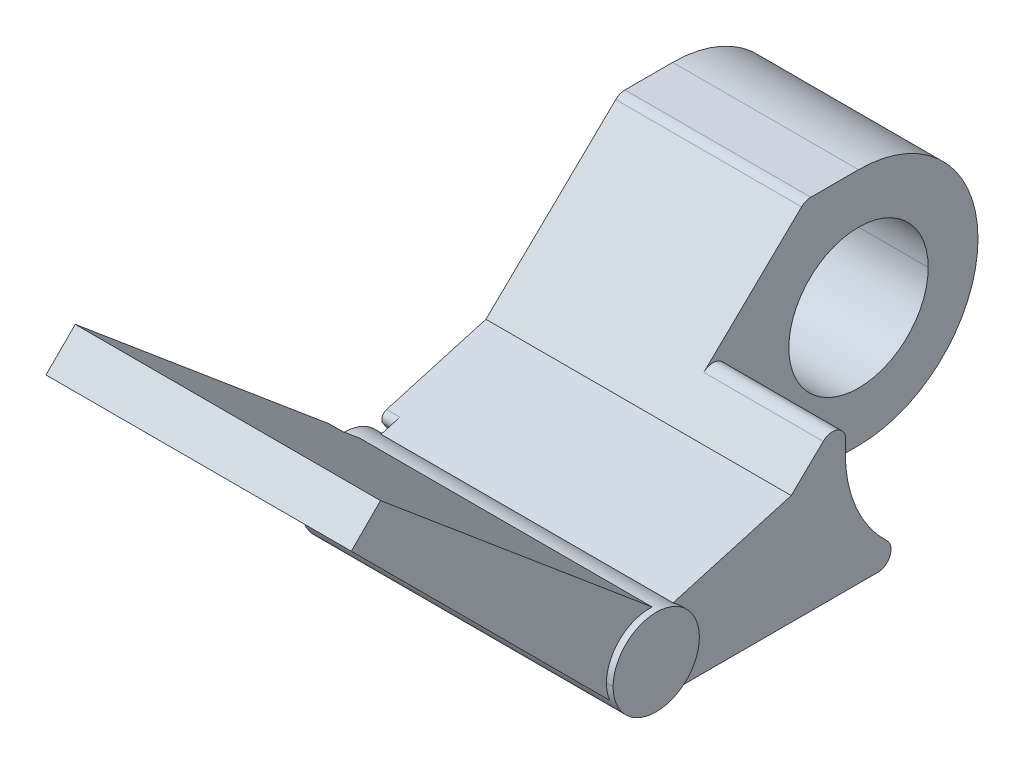
ISO-10303-21;
HEADER;
FILE_DESCRIPTION(('STEP AP214'),'2;1');
FILE_NAME('part.step','',(''),(''),'','','');
FILE_SCHEMA(('AUTOMOTIVE_DESIGN { 1 0 10303 214 1 1 1 1 }'));
ENDSEC;
DATA;
#1=APPLICATION_CONTEXT('core data for automotive mechanical design processes');
#2=APPLICATION_PROTOCOL_DEFINITION('international standard','automotive_design',2000,#1);
#3=PRODUCT_CONTEXT('',#1,'mechanical');
#4=PRODUCT('Part','Part','',(#3));
#5=PRODUCT_RELATED_PRODUCT_CATEGORY('part','',(#4));
#6=PRODUCT_DEFINITION_FORMATION('','',#4);
#7=PRODUCT_DEFINITION_CONTEXT('part definition',#1,'design');
#8=PRODUCT_DEFINITION('design','',#6,#7);
#9=PRODUCT_DEFINITION_SHAPE('','',#8);
#10=(LENGTH_UNIT() NAMED_UNIT(*) SI_UNIT(.MILLI.,.METRE.));
#11=(NAMED_UNIT(*) PLANE_ANGLE_UNIT() SI_UNIT($,.RADIAN.));
#12=(NAMED_UNIT(*) SI_UNIT($,.STERADIAN.) SOLID_ANGLE_UNIT());
#13=UNCERTAINTY_MEASURE_WITH_UNIT(LENGTH_MEASURE(1.E-05),#10,'distance_accuracy_value','');
#14=(GEOMETRIC_REPRESENTATION_CONTEXT(3) GLOBAL_UNCERTAINTY_ASSIGNED_CONTEXT((#13)) GLOBAL_UNIT_ASSIGNED_CONTEXT((#10,
#11,#12)) REPRESENTATION_CONTEXT('',''));
#15=CARTESIAN_POINT('',(0.,0.,0.));
#16=DIRECTION('',(0.,0.,1.));
#17=DIRECTION('',(1.,0.,0.));
#18=AXIS2_PLACEMENT_3D('',#15,#16,#17);
#19=CARTESIAN_POINT('',(-23.,17.,3.59597377416485));
#20=DIRECTION('',(1.,0.,0.));
#21=DIRECTION('',(0.,0.,1.));
#22=AXIS2_PLACEMENT_3D('',#19,#20,#21);
#23=CYLINDRICAL_SURFACE('',#22,1.);
#24=CARTESIAN_POINT('',(-23.,17.,3.59597377416485));
#25=DIRECTION('',(1.,0.,0.));
#26=DIRECTION('',(0.,0.,-1.));
#27=AXIS2_PLACEMENT_3D('',#24,#25,#26);
#28=CIRCLE('',#27,1.);
#29=CARTESIAN_POINT('',(-23.,18.,3.59597377416485));
#30=VERTEX_POINT('',#29);
#31=CARTESIAN_POINT('',(-23.,17.7193398003386,4.29063214462384));
#32=VERTEX_POINT('',#31);
#33=EDGE_CURVE('E291',#30,#32,#28,.T.);
#34=ORIENTED_EDGE('',*,*,#33,.T.);
#35=DIRECTION('',(1.,0.,0.));
#36=VECTOR('',#35,1.);
#37=CARTESIAN_POINT('',(-23.,17.7193398003386,4.29063214462384));
#38=LINE('',#37,#36);
#39=CARTESIAN_POINT('',(-9.,17.7193398003386,4.29063214462385));
#40=VERTEX_POINT('',#39);
#41=EDGE_CURVE('E510',#32,#40,#38,.T.);
#42=ORIENTED_EDGE('',*,*,#41,.T.);
#43=CARTESIAN_POINT('',(-9.,17.,3.59597377416485));
#44=DIRECTION('',(-1.,0.,0.));
#45=DIRECTION('',(0.,0.,1.));
#46=AXIS2_PLACEMENT_3D('',#43,#44,#45);
#47=CIRCLE('',#46,1.);
#48=CARTESIAN_POINT('',(-9.,18.,3.59597377416485));
#49=VERTEX_POINT('',#48);
#50=EDGE_CURVE('E302',#40,#49,#47,.T.);
#51=ORIENTED_EDGE('',*,*,#50,.T.);
#52=DIRECTION('',(-1.,0.,0.));
#53=VECTOR('',#52,1.);
#54=CARTESIAN_POINT('',(-23.,18.,3.59597377416485));
#55=LINE('',#54,#53);
#56=EDGE_CURVE('E409',#49,#30,#55,.T.);
#57=ORIENTED_EDGE('',*,*,#56,.T.);
#58=EDGE_LOOP('',(#34,#42,#51,#57));
#59=FACE_BOUND('',#58,.T.);
#60=ADVANCED_FACE('F14',(#59),#23,.T.);
#61=CARTESIAN_POINT('',(-22.,0.5,21.302643481786));
#62=DIRECTION('',(-1.,0.,0.));
#63=DIRECTION('',(0.,0.,-1.));
#64=AXIS2_PLACEMENT_3D('',#61,#62,#63);
#65=CYLINDRICAL_SURFACE('',#64,0.5);
#66=CARTESIAN_POINT('',(-22.,0.5,21.302643481786));
#67=DIRECTION('',(-1.,0.,0.));
#68=DIRECTION('',(0.,0.,-1.));
#69=AXIS2_PLACEMENT_3D('',#66,#67,#68);
#70=CIRCLE('',#69,0.5);
#71=CARTESIAN_POINT('',(-22.,0.,21.302643481786));
#72=VERTEX_POINT('',#71);
#73=CARTESIAN_POINT('',(-22.,0.793724262730775,21.7072742486381));
#74=VERTEX_POINT('',#73);
#75=EDGE_CURVE('E308',#72,#74,#70,.T.);
#76=ORIENTED_EDGE('',*,*,#75,.T.);
#77=DIRECTION('',(-1.,0.,0.));
#78=VECTOR('',#77,1.);
#79=CARTESIAN_POINT('',(-22.,0.793724262730776,21.7072742486381));
#80=LINE('',#79,#78);
#81=CARTESIAN_POINT('',(-23.,0.793724262730775,21.7072742486381));
#82=VERTEX_POINT('',#81);
#83=EDGE_CURVE('E403',#74,#82,#80,.T.);
#84=ORIENTED_EDGE('',*,*,#83,.T.);
#85=CARTESIAN_POINT('',(-23.,0.5,21.302643481786));
#86=DIRECTION('',(1.,0.,0.));
#87=DIRECTION('',(0.,0.,-1.));
#88=AXIS2_PLACEMENT_3D('',#85,#86,#87);
#89=CIRCLE('',#88,0.5);
#90=CARTESIAN_POINT('',(-23.,0.,21.302643481786));
#91=VERTEX_POINT('',#90);
#92=EDGE_CURVE('E339',#82,#91,#89,.T.);
#93=ORIENTED_EDGE('',*,*,#92,.T.);
#94=DIRECTION('',(1.,0.,0.));
#95=VECTOR('',#94,1.);
#96=CARTESIAN_POINT('',(-22.,0.,21.302643481786));
#97=LINE('',#96,#95);
#98=EDGE_CURVE('E290',#91,#72,#97,.T.);
#99=ORIENTED_EDGE('',*,*,#98,.T.);
#100=EDGE_LOOP('',(#76,#84,#93,#99));
#101=FACE_BOUND('',#100,.T.);
#102=ADVANCED_FACE('F655',(#101),#65,.T.);
#103=CARTESIAN_POINT('',(-22.,5.64730748684892,21.4198749707261));
#104=DIRECTION('',(-1.,0.,0.));
#105=DIRECTION('',(0.,0.,-1.));
#106=AXIS2_PLACEMENT_3D('',#103,#104,#105);
#107=CYLINDRICAL_SURFACE('',#106,0.5);
#108=CARTESIAN_POINT('',(-22.,5.64730748684892,21.4198749707261));
#109=DIRECTION('',(-1.,0.,0.));
#110=DIRECTION('',(0.,0.,-1.));
#111=AXIS2_PLACEMENT_3D('',#108,#109,#110);
#112=CIRCLE('',#111,0.5);
#113=CARTESIAN_POINT('',(-22.,5.33546616289159,21.8107137977028));
#114=VERTEX_POINT('',#113);
#115=CARTESIAN_POINT('',(-22.,6.12793833481808,21.5576936486347));
#116=VERTEX_POINT('',#115);
#117=EDGE_CURVE('E466',#114,#116,#112,.T.);
#118=ORIENTED_EDGE('',*,*,#117,.T.);
#119=DIRECTION('',(-1.,0.,0.));
#120=VECTOR('',#119,1.);
#121=CARTESIAN_POINT('',(-23.,6.12793833481808,21.5576936486347));
#122=LINE('',#121,#120);
#123=CARTESIAN_POINT('',(-23.,6.12793833481808,21.5576936486347));
#124=VERTEX_POINT('',#123);
#125=EDGE_CURVE('E387',#116,#124,#122,.T.);
#126=ORIENTED_EDGE('',*,*,#125,.T.);
#127=CARTESIAN_POINT('',(-23.,5.64730748684892,21.4198749707261));
#128=DIRECTION('',(1.,0.,0.));
#129=DIRECTION('',(0.,0.,-1.));
#130=AXIS2_PLACEMENT_3D('',#127,#128,#129);
#131=CIRCLE('',#130,0.5);
#132=CARTESIAN_POINT('',(-23.,5.33546616289159,21.8107137977028));
#133=VERTEX_POINT('',#132);
#134=EDGE_CURVE('E295',#124,#133,#131,.T.);
#135=ORIENTED_EDGE('',*,*,#134,.T.);
#136=DIRECTION('',(1.,0.,0.));
#137=VECTOR('',#136,1.);
#138=CARTESIAN_POINT('',(-22.,5.33546616289159,21.8107137977028));
#139=LINE('',#138,#137);
#140=EDGE_CURVE('E301',#133,#114,#139,.T.);
#141=ORIENTED_EDGE('',*,*,#140,.T.);
#142=EDGE_LOOP('',(#118,#126,#135,#141));
#143=FACE_BOUND('',#142,.T.);
#144=ADVANCED_FACE('F543',(#143),#107,.T.);
#145=CARTESIAN_POINT('',(-22.,3.64878220999846,28.9416754288119));
#146=DIRECTION('',(-1.,0.,0.));
#147=DIRECTION('',(0.,0.,-1.));
#148=AXIS2_PLACEMENT_3D('',#145,#146,#147);
#149=CYLINDRICAL_SURFACE('',#148,0.5);
#150=CARTESIAN_POINT('',(-23.,3.64878220999846,28.9416754288119));
#151=DIRECTION('',(1.,0.,0.));
#152=DIRECTION('',(0.,0.,-1.));
#153=AXIS2_PLACEMENT_3D('',#150,#151,#152);
#154=CIRCLE('',#153,0.5);
#155=CARTESIAN_POINT('',(-23.,3.29522881940518,29.2952288194051));
#156=VERTEX_POINT('',#155);
#157=CARTESIAN_POINT('',(-23.,3.57206150684706,28.4475965548373));
#158=VERTEX_POINT('',#157);
#159=EDGE_CURVE('E451',#156,#158,#154,.T.);
#160=ORIENTED_EDGE('',*,*,#159,.T.);
#161=DIRECTION('',(1.,0.,0.));
#162=VECTOR('',#161,1.);
#163=CARTESIAN_POINT('',(-22.,3.57206150684706,28.4475965548373));
#164=LINE('',#163,#162);
#165=CARTESIAN_POINT('',(-22.,3.57206150684706,28.4475965548373));
#166=VERTEX_POINT('',#165);
#167=EDGE_CURVE('E307',#158,#166,#164,.T.);
#168=ORIENTED_EDGE('',*,*,#167,.T.);
#169=CARTESIAN_POINT('',(-22.,3.64878220999846,28.9416754288119));
#170=DIRECTION('',(-1.,0.,0.));
#171=DIRECTION('',(0.,0.,-1.));
#172=AXIS2_PLACEMENT_3D('',#169,#170,#171);
#173=CIRCLE('',#172,0.5);
#174=CARTESIAN_POINT('',(-22.,3.29522881940518,29.2952288194051));
#175=VERTEX_POINT('',#174);
#176=EDGE_CURVE('E25',#166,#175,#173,.T.);
#177=ORIENTED_EDGE('',*,*,#176,.T.);
#178=DIRECTION('',(-1.,0.,0.));
#179=VECTOR('',#178,1.);
#180=CARTESIAN_POINT('',(-23.,3.29522881940518,29.2952288194051));
#181=LINE('',#180,#179);
#182=EDGE_CURVE('E317',#175,#156,#181,.T.);
#183=ORIENTED_EDGE('',*,*,#182,.T.);
#184=EDGE_LOOP('',(#160,#168,#177,#183));
#185=FACE_BOUND('',#184,.T.);
#186=ADVANCED_FACE('F1264',(#185),#149,.T.);
#187=CARTESIAN_POINT('',(-22.,6.98529548453996,26.2094030110542));
#188=DIRECTION('',(-1.,0.,0.));
#189=DIRECTION('',(0.,0.,-1.));
#190=AXIS2_PLACEMENT_3D('',#187,#188,#189);
#191=CYLINDRICAL_SURFACE('',#190,0.5);
#192=DIRECTION('',(-1.,0.,0.));
#193=VECTOR('',#192,1.);
#194=CARTESIAN_POINT('',(-22.,6.98529548453996,25.7094030110542));
#195=LINE('',#194,#193);
#196=CARTESIAN_POINT('',(-22.,6.98529548453996,25.7094030110542));
#197=VERTEX_POINT('',#196);
#198=CARTESIAN_POINT('',(-23.,6.98529548453996,25.7094030110542));
#199=VERTEX_POINT('',#198);
#200=EDGE_CURVE('E398',#197,#199,#195,.T.);
#201=ORIENTED_EDGE('',*,*,#200,.F.);
#202=CARTESIAN_POINT('',(-22.,6.98529548453996,26.2094030110542));
#203=DIRECTION('',(-1.,0.,0.));
#204=DIRECTION('',(0.,0.,-1.));
#205=AXIS2_PLACEMENT_3D('',#202,#203,#204);
#206=CIRCLE('',#205,0.5);
#207=CARTESIAN_POINT('',(-22.,6.5160438079131,26.0367679509335));
#208=VERTEX_POINT('',#207);
#209=EDGE_CURVE('E9',#197,#208,#206,.T.);
#210=ORIENTED_EDGE('',*,*,#209,.T.);
#211=DIRECTION('',(-1.,0.,0.));
#212=VECTOR('',#211,1.);
#213=CARTESIAN_POINT('',(-22.,6.5160438079131,26.0367679509335));
#214=LINE('',#213,#212);
#215=CARTESIAN_POINT('',(-23.,6.5160438079131,26.0367679509335));
#216=VERTEX_POINT('',#215);
#217=EDGE_CURVE('E469',#208,#216,#214,.T.);
#218=ORIENTED_EDGE('',*,*,#217,.T.);
#219=CARTESIAN_POINT('',(-23.,6.98529548453996,26.2094030110542));
#220=DIRECTION('',(1.,0.,0.));
#221=DIRECTION('',(0.,0.,-1.));
#222=AXIS2_PLACEMENT_3D('',#219,#220,#221);
#223=CIRCLE('',#222,0.5);
#224=EDGE_CURVE('E371',#216,#199,#223,.T.);
#225=ORIENTED_EDGE('',*,*,#224,.T.);
#226=EDGE_LOOP('',(#201,#210,#218,#225));
#227=FACE_BOUND('',#226,.T.);
#228=ADVANCED_FACE('F1259',(#227),#191,.T.);
#229=CARTESIAN_POINT('',(-22.,2.99665623321162,24.7420050000283));
#230=DIRECTION('',(-1.,0.,0.));
#231=DIRECTION('',(0.,0.,1.));
#232=AXIS2_PLACEMENT_3D('',#229,#230,#231);
#233=PLANE('',#232);
#234=DIRECTION('',(0.,-0.642787609686543,-0.766044443118975));
#235=VECTOR('',#234,1.);
#236=CARTESIAN_POINT('',(-22.,-8.42344976404674,7.06811359025203));
#237=LINE('',#236,#235);
#238=CARTESIAN_POINT('',(-22.,7.36831770609945,25.8880092062109));
#239=VERTEX_POINT('',#238);
#240=CARTESIAN_POINT('',(-22.,6.24062355295245,24.5440756478505));
#241=VERTEX_POINT('',#240);
#242=EDGE_CURVE('E437',#239,#241,#237,.T.);
#243=ORIENTED_EDGE('',*,*,#242,.T.);
#244=CARTESIAN_POINT('',(-22.,2.99665623321162,24.7420050000283));
#245=DIRECTION('',(1.,0.,0.));
#246=DIRECTION('',(0.,0.,-1.));
#247=AXIS2_PLACEMENT_3D('',#244,#245,#246);
#248=CIRCLE('',#247,3.25);
#249=CARTESIAN_POINT('',(-22.,2.99665623321162,27.9920050000283));
#250=VERTEX_POINT('',#249);
#251=EDGE_CURVE('E258',#241,#250,#248,.T.);
#252=ORIENTED_EDGE('',*,*,#251,.T.);
#253=CARTESIAN_POINT('',(-22.,2.99665623321162,24.7420050000283));
#254=DIRECTION('',(1.,0.,0.));
#255=DIRECTION('',(0.,0.,-1.));
#256=AXIS2_PLACEMENT_3D('',#253,#254,#255);
#257=CIRCLE('',#256,3.25);
#258=CARTESIAN_POINT('',(-22.,1.73866123323988,27.7386612332399));
#259=VERTEX_POINT('',#258);
#260=EDGE_CURVE('E324',#250,#259,#257,.T.);
#261=ORIENTED_EDGE('',*,*,#260,.T.);
#262=DIRECTION('',(0.,0.707106781186549,0.707106781186546));
#263=VECTOR('',#262,1.);
#264=CARTESIAN_POINT('',(-22.,-13.,13.));
#265=LINE('',#264,#263);
#266=EDGE_CURVE('E314',#259,#175,#265,.T.);
#267=ORIENTED_EDGE('',*,*,#266,.T.);
#268=ORIENTED_EDGE('',*,*,#176,.F.);
#269=CARTESIAN_POINT('',(-22.,2.99665623321162,24.7420050000283));
#270=DIRECTION('',(1.,0.,0.));
#271=DIRECTION('',(0.,0.,-1.));
#272=AXIS2_PLACEMENT_3D('',#269,#270,#271);
#273=CIRCLE('',#272,3.75);
#274=EDGE_CURVE('E303',#208,#166,#273,.T.);
#275=ORIENTED_EDGE('',*,*,#274,.F.);
#276=ORIENTED_EDGE('',*,*,#209,.F.);
#277=CARTESIAN_POINT('',(-22.,6.98529548453996,26.2094030110542));
#278=DIRECTION('',(-1.,0.,0.));
#279=DIRECTION('',(0.,0.,-1.));
#280=AXIS2_PLACEMENT_3D('',#277,#278,#279);
#281=CIRCLE('',#280,0.5);
#282=EDGE_CURVE('E486',#239,#197,#281,.T.);
#283=ORIENTED_EDGE('',*,*,#282,.F.);
#284=EDGE_LOOP('',(#243,#252,#261,#267,#268,#275,#276,#283));
#285=FACE_BOUND('',#284,.T.);
#286=ADVANCED_FACE('F1263',(#285),#233,.T.);
#287=CARTESIAN_POINT('',(-22.,2.99665623321162,24.7420050000283));
#288=DIRECTION('',(-1.,0.,0.));
#289=DIRECTION('',(0.,0.,-1.));
#290=AXIS2_PLACEMENT_3D('',#287,#288,#289);
#291=CYLINDRICAL_SURFACE('',#290,3.75);
#292=ORIENTED_EDGE('',*,*,#274,.T.);
#293=ORIENTED_EDGE('',*,*,#167,.F.);
#294=CARTESIAN_POINT('',(-23.,2.99665623321162,24.7420050000283));
#295=DIRECTION('',(1.,0.,0.));
#296=DIRECTION('',(0.,0.,-1.));
#297=AXIS2_PLACEMENT_3D('',#294,#295,#296);
#298=CIRCLE('',#297,3.75);
#299=EDGE_CURVE('E430',#216,#158,#298,.T.);
#300=ORIENTED_EDGE('',*,*,#299,.F.);
#301=ORIENTED_EDGE('',*,*,#217,.F.);
#302=EDGE_LOOP('',(#292,#293,#300,#301));
#303=FACE_BOUND('',#302,.T.);
#304=ADVANCED_FACE('F16',(#303),#291,.F.);
#305=CARTESIAN_POINT('',(-22.,2.99665623321162,24.7420050000283));
#306=DIRECTION('',(-1.,0.,0.));
#307=DIRECTION('',(0.,0.,1.));
#308=AXIS2_PLACEMENT_3D('',#305,#306,#307);
#309=PLANE('',#308);
#310=DIRECTION('',(0.,-0.275637355817,0.961261695938319));
#311=VECTOR('',#310,1.);
#312=CARTESIAN_POINT('',(-22.,11.3742809649369,3.26152258301993));
#313=LINE('',#312,#311);
#314=CARTESIAN_POINT('',(-22.,5.7223893692874,22.9720109687111));
#315=VERTEX_POINT('',#314);
#316=EDGE_CURVE('E532',#116,#315,#313,.T.);
#317=ORIENTED_EDGE('',*,*,#316,.F.);
#318=ORIENTED_EDGE('',*,*,#117,.F.);
#319=CARTESIAN_POINT('',(-22.,2.99665623321162,24.7420050000283));
#320=DIRECTION('',(1.,0.,0.));
#321=DIRECTION('',(0.,0.,-1.));
#322=AXIS2_PLACEMENT_3D('',#319,#320,#321);
#323=CIRCLE('',#322,3.75);
#324=CARTESIAN_POINT('',(-22.,2.99665623321162,20.9920050000283));
#325=VERTEX_POINT('',#324);
#326=EDGE_CURVE('E297',#325,#114,#323,.T.);
#327=ORIENTED_EDGE('',*,*,#326,.F.);
#328=CARTESIAN_POINT('',(-22.,2.99665623321162,24.7420050000283));
#329=DIRECTION('',(1.,0.,0.));
#330=DIRECTION('',(0.,0.,-1.));
#331=AXIS2_PLACEMENT_3D('',#328,#329,#330);
#332=CIRCLE('',#331,3.75);
#333=EDGE_CURVE('E350',#74,#325,#332,.T.);
#334=ORIENTED_EDGE('',*,*,#333,.F.);
#335=ORIENTED_EDGE('',*,*,#75,.F.);
#336=DIRECTION('',(0.,0.,1.));
#337=VECTOR('',#336,1.);
#338=CARTESIAN_POINT('',(-22.,0.,0.));
#339=LINE('',#338,#337);
#340=CARTESIAN_POINT('',(-22.,0.,23.4840100000565));
#341=VERTEX_POINT('',#340);
#342=EDGE_CURVE('E334',#72,#341,#339,.T.);
#343=ORIENTED_EDGE('',*,*,#342,.T.);
#344=CARTESIAN_POINT('',(-22.,2.99665623321162,24.7420050000283));
#345=DIRECTION('',(1.,0.,0.));
#346=DIRECTION('',(0.,0.,-1.));
#347=AXIS2_PLACEMENT_3D('',#344,#345,#346);
#348=CIRCLE('',#347,3.25);
#349=CARTESIAN_POINT('',(-22.,2.99665623321162,21.4920050000283));
#350=VERTEX_POINT('',#349);
#351=EDGE_CURVE('E426',#341,#350,#348,.T.);
#352=ORIENTED_EDGE('',*,*,#351,.T.);
#353=CARTESIAN_POINT('',(-22.,2.99665623321162,24.7420050000283));
#354=DIRECTION('',(1.,0.,0.));
#355=DIRECTION('',(0.,0.,-1.));
#356=AXIS2_PLACEMENT_3D('',#353,#354,#355);
#357=CIRCLE('',#356,3.25);
#358=EDGE_CURVE('E257',#350,#315,#357,.T.);
#359=ORIENTED_EDGE('',*,*,#358,.T.);
#360=EDGE_LOOP('',(#317,#318,#327,#334,#335,#343,#352,#359));
#361=FACE_BOUND('',#360,.T.);
#362=ADVANCED_FACE('F555',(#361),#309,.T.);
#363=CARTESIAN_POINT('',(-22.,2.99665623321162,24.7420050000283));
#364=DIRECTION('',(-1.,0.,0.));
#365=DIRECTION('',(0.,0.,-1.));
#366=AXIS2_PLACEMENT_3D('',#363,#364,#365);
#367=CYLINDRICAL_SURFACE('',#366,3.75);
#368=DIRECTION('',(-1.,0.,0.));
#369=VECTOR('',#368,1.);
#370=CARTESIAN_POINT('',(-22.,2.99665623321162,20.9920050000283));
#371=LINE('',#370,#369);
#372=CARTESIAN_POINT('',(-23.,2.99665623321162,20.9920050000283));
#373=VERTEX_POINT('',#372);
#374=EDGE_CURVE('E404',#325,#373,#371,.T.);
#375=ORIENTED_EDGE('',*,*,#374,.F.);
#376=ORIENTED_EDGE('',*,*,#326,.T.);
#377=ORIENTED_EDGE('',*,*,#140,.F.);
#378=CARTESIAN_POINT('',(-23.,2.99665623321162,24.7420050000283));
#379=DIRECTION('',(1.,0.,0.));
#380=DIRECTION('',(0.,0.,-1.));
#381=AXIS2_PLACEMENT_3D('',#378,#379,#380);
#382=CIRCLE('',#381,3.75);
#383=EDGE_CURVE('E335',#373,#133,#382,.T.);
#384=ORIENTED_EDGE('',*,*,#383,.F.);
#385=EDGE_LOOP('',(#375,#376,#377,#384));
#386=FACE_BOUND('',#385,.T.);
#387=ADVANCED_FACE('F549',(#386),#367,.F.);
#388=CARTESIAN_POINT('',(0.5,2.99665623321162,24.7420050000283));
#389=DIRECTION('',(1.,0.,0.));
#390=DIRECTION('',(0.,1.,0.));
#391=AXIS2_PLACEMENT_3D('',#388,#389,#390);
#392=PLANE('',#391);
#393=CARTESIAN_POINT('',(0.5,2.99665623321162,24.7420050000283));
#394=DIRECTION('',(-1.,0.,0.));
#395=DIRECTION('',(0.,0.,1.));
#396=AXIS2_PLACEMENT_3D('',#393,#394,#395);
#397=CIRCLE('',#396,3.25);
#398=CARTESIAN_POINT('',(0.5,2.99665623321162,27.9920050000283));
#399=VERTEX_POINT('',#398);
#400=CARTESIAN_POINT('',(0.5,2.99665623321162,21.4920050000283));
#401=VERTEX_POINT('',#400);
#402=EDGE_CURVE('E248',#399,#401,#397,.T.);
#403=ORIENTED_EDGE('',*,*,#402,.F.);
#404=CARTESIAN_POINT('',(0.5,2.99665623321162,24.7420050000283));
#405=DIRECTION('',(-1.,0.,0.));
#406=DIRECTION('',(0.,0.,1.));
#407=AXIS2_PLACEMENT_3D('',#404,#405,#406);
#408=CIRCLE('',#407,3.25);
#409=EDGE_CURVE('E252',#401,#399,#408,.T.);
#410=ORIENTED_EDGE('',*,*,#409,.F.);
#411=EDGE_LOOP('',(#403,#410));
#412=FACE_BOUND('',#411,.T.);
#413=ADVANCED_FACE('F250',(#412),#392,.T.);
#414=CARTESIAN_POINT('',(-9.,9.88440397573025,10.9643891579838));
#415=DIRECTION('',(1.,0.,0.));
#416=DIRECTION('',(0.,0.,1.));
#417=AXIS2_PLACEMENT_3D('',#414,#415,#416);
#418=CYLINDRICAL_SURFACE('',#417,1.);
#419=CARTESIAN_POINT('',(-9.,9.88440397573025,10.9643891579838));
#420=DIRECTION('',(1.,0.,0.));
#421=DIRECTION('',(0.,0.,1.));
#422=AXIS2_PLACEMENT_3D('',#419,#420,#421);
#423=CIRCLE('',#422,1.);
#424=CARTESIAN_POINT('',(-9.,9.80400361430023,9.96762650725799));
#425=VERTEX_POINT('',#424);
#426=CARTESIAN_POINT('',(-9.,10.6037437760689,11.6590475284428));
#427=VERTEX_POINT('',#426);
#428=EDGE_CURVE('E459',#425,#427,#423,.T.);
#429=ORIENTED_EDGE('',*,*,#428,.T.);
#430=DIRECTION('',(1.,0.,0.));
#431=VECTOR('',#430,1.);
#432=CARTESIAN_POINT('',(-23.,10.6037437760689,11.6590475284428));
#433=LINE('',#432,#431);
#434=CARTESIAN_POINT('',(0.,10.6037437760689,11.6590475284428));
#435=VERTEX_POINT('',#434);
#436=EDGE_CURVE('E289',#427,#435,#433,.T.);
#437=ORIENTED_EDGE('',*,*,#436,.T.);
#438=CARTESIAN_POINT('',(0.,9.88440397573025,10.9643891579838));
#439=DIRECTION('',(-1.,0.,0.));
#440=DIRECTION('',(0.,0.,-1.));
#441=AXIS2_PLACEMENT_3D('',#438,#439,#440);
#442=CIRCLE('',#441,1.);
#443=CARTESIAN_POINT('',(0.,9.80400361430023,9.96762650725799));
#444=VERTEX_POINT('',#443);
#445=EDGE_CURVE('E622',#435,#444,#442,.T.);
#446=ORIENTED_EDGE('',*,*,#445,.T.);
#447=DIRECTION('',(-1.,0.,0.));
#448=VECTOR('',#447,1.);
#449=CARTESIAN_POINT('',(-9.,9.80400361430023,9.96762650725799));
#450=LINE('',#449,#448);
#451=EDGE_CURVE('E75',#444,#425,#450,.T.);
#452=ORIENTED_EDGE('',*,*,#451,.T.);
#453=EDGE_LOOP('',(#429,#437,#446,#452));
#454=FACE_BOUND('',#453,.T.);
#455=ADVANCED_FACE('F1141',(#454),#418,.T.);
#456=CARTESIAN_POINT('',(-9.,1.,7.54983443527075));
#457=DIRECTION('',(1.,0.,0.));
#458=DIRECTION('',(0.,0.,1.));
#459=AXIS2_PLACEMENT_3D('',#456,#457,#458);
#460=CYLINDRICAL_SURFACE('',#459,1.);
#461=CARTESIAN_POINT('',(-9.,1.,7.54983443527075));
#462=DIRECTION('',(1.,0.,0.));
#463=DIRECTION('',(0.,0.,1.));
#464=AXIS2_PLACEMENT_3D('',#461,#462,#463);
#465=CIRCLE('',#464,1.);
#466=CARTESIAN_POINT('',(-9.,0.,7.54983443527075));
#467=VERTEX_POINT('',#466);
#468=CARTESIAN_POINT('',(-9.,1.72727272727273,6.86348585024614));
#469=VERTEX_POINT('',#468);
#470=EDGE_CURVE('E514',#467,#469,#465,.T.);
#471=ORIENTED_EDGE('',*,*,#470,.T.);
#472=DIRECTION('',(1.,0.,0.));
#473=VECTOR('',#472,1.);
#474=CARTESIAN_POINT('',(-9.,1.72727272727273,6.86348585024614));
#475=LINE('',#474,#473);
#476=CARTESIAN_POINT('',(0.,1.72727272727273,6.86348585024614));
#477=VERTEX_POINT('',#476);
#478=EDGE_CURVE('E382',#469,#477,#475,.T.);
#479=ORIENTED_EDGE('',*,*,#478,.T.);
#480=CARTESIAN_POINT('',(0.,1.,7.54983443527075));
#481=DIRECTION('',(-1.,0.,0.));
#482=DIRECTION('',(0.,0.,-1.));
#483=AXIS2_PLACEMENT_3D('',#480,#481,#482);
#484=CIRCLE('',#483,1.);
#485=CARTESIAN_POINT('',(0.,0.,7.54983443527075));
#486=VERTEX_POINT('',#485);
#487=EDGE_CURVE('E362',#477,#486,#484,.T.);
#488=ORIENTED_EDGE('',*,*,#487,.T.);
#489=DIRECTION('',(-1.,0.,0.));
#490=VECTOR('',#489,1.);
#491=CARTESIAN_POINT('',(-9.,0.,7.54983443527075));
#492=LINE('',#491,#490);
#493=EDGE_CURVE('E92',#486,#467,#492,.T.);
#494=ORIENTED_EDGE('',*,*,#493,.T.);
#495=EDGE_LOOP('',(#471,#479,#488,#494));
#496=FACE_BOUND('',#495,.T.);
#497=ADVANCED_FACE('F911',(#496),#460,.T.);
#498=CARTESIAN_POINT('',(-9.,0.,0.));
#499=DIRECTION('',(1.,0.,0.));
#500=DIRECTION('',(0.,1.,0.));
#501=AXIS2_PLACEMENT_3D('',#498,#499,#500);
#502=PLANE('',#501);
#503=CARTESIAN_POINT('',(-9.,9.,0.));
#504=DIRECTION('',(1.,0.,0.));
#505=DIRECTION('',(0.,0.,1.));
#506=AXIS2_PLACEMENT_3D('',#503,#504,#505);
#507=CIRCLE('',#506,5.25);
#508=CARTESIAN_POINT('',(-9.,9.,5.25));
#509=VERTEX_POINT('',#508);
#510=CARTESIAN_POINT('',(-9.,9.,-5.25));
#511=VERTEX_POINT('',#510);
#512=EDGE_CURVE('E408',#509,#511,#507,.T.);
#513=ORIENTED_EDGE('',*,*,#512,.F.);
#514=CARTESIAN_POINT('',(-9.,9.,0.));
#515=DIRECTION('',(1.,0.,0.));
#516=DIRECTION('',(0.,0.,1.));
#517=AXIS2_PLACEMENT_3D('',#514,#515,#516);
#518=CIRCLE('',#517,5.25);
#519=EDGE_CURVE('E389',#511,#509,#518,.T.);
#520=ORIENTED_EDGE('',*,*,#519,.F.);
#521=EDGE_LOOP('',(#513,#520));
#522=FACE_BOUND('',#521,.T.);
#523=DIRECTION('',(0.,0.694658370458999,-0.71933980033865));
#524=VECTOR('',#523,1.);
#525=CARTESIAN_POINT('',(-9.,11.3128771243607,10.9247184497669));
#526=LINE('',#525,#524);
#527=EDGE_CURVE('E415',#427,#40,#526,.T.);
#528=ORIENTED_EDGE('',*,*,#527,.F.);
#529=ORIENTED_EDGE('',*,*,#428,.F.);
#530=CARTESIAN_POINT('',(-9.,9.,0.));
#531=DIRECTION('',(-1.,0.,0.));
#532=DIRECTION('',(0.,0.,1.));
#533=AXIS2_PLACEMENT_3D('',#530,#531,#532);
#534=CIRCLE('',#533,10.);
#535=CARTESIAN_POINT('',(-9.,9.,10.));
#536=VERTEX_POINT('',#535);
#537=EDGE_CURVE('E294',#536,#425,#534,.T.);
#538=ORIENTED_EDGE('',*,*,#537,.F.);
#539=CARTESIAN_POINT('',(-9.,9.,0.));
#540=DIRECTION('',(-1.,0.,0.));
#541=DIRECTION('',(0.,0.,1.));
#542=AXIS2_PLACEMENT_3D('',#539,#540,#541);
#543=CIRCLE('',#542,10.);
#544=EDGE_CURVE('E313',#469,#536,#543,.T.);
#545=ORIENTED_EDGE('',*,*,#544,.F.);
#546=ORIENTED_EDGE('',*,*,#470,.F.);
#547=DIRECTION('',(0.,0.,1.));
#548=VECTOR('',#547,1.);
#549=CARTESIAN_POINT('',(-9.,0.,0.));
#550=LINE('',#549,#548);
#551=CARTESIAN_POINT('',(-9.,0.,0.));
#552=VERTEX_POINT('',#551);
#553=EDGE_CURVE('E358',#552,#467,#550,.T.);
#554=ORIENTED_EDGE('',*,*,#553,.F.);
#555=CARTESIAN_POINT('',(-9.,9.,0.));
#556=DIRECTION('',(-1.,0.,0.));
#557=DIRECTION('',(0.,0.,1.));
#558=AXIS2_PLACEMENT_3D('',#555,#556,#557);
#559=CIRCLE('',#558,9.);
#560=CARTESIAN_POINT('',(-9.,18.,0.));
#561=VERTEX_POINT('',#560);
#562=EDGE_CURVE('E377',#561,#552,#559,.T.);
#563=ORIENTED_EDGE('',*,*,#562,.F.);
#564=DIRECTION('',(0.,0.,-1.));
#565=VECTOR('',#564,1.);
#566=CARTESIAN_POINT('',(-9.,18.,0.));
#567=LINE('',#566,#565);
#568=EDGE_CURVE('E352',#49,#561,#567,.T.);
#569=ORIENTED_EDGE('',*,*,#568,.F.);
#570=ORIENTED_EDGE('',*,*,#50,.F.);
#571=EDGE_LOOP('',(#528,#529,#538,#545,#546,#554,#563,#569,#570));
#572=FACE_BOUND('',#571,.T.);
#573=ADVANCED_FACE('F1229',(#522,#572),#502,.T.);
#574=CARTESIAN_POINT('',(-9.,9.,0.));
#575=DIRECTION('',(1.,0.,0.));
#576=DIRECTION('',(0.,0.,1.));
#577=AXIS2_PLACEMENT_3D('',#574,#575,#576);
#578=CYLINDRICAL_SURFACE('',#577,10.);
#579=DIRECTION('',(1.,0.,0.));
#580=VECTOR('',#579,1.);
#581=CARTESIAN_POINT('',(-9.,9.,10.));
#582=LINE('',#581,#580);
#583=CARTESIAN_POINT('',(0.,9.,10.));
#584=VERTEX_POINT('',#583);
#585=EDGE_CURVE('E309',#536,#584,#582,.T.);
#586=ORIENTED_EDGE('',*,*,#585,.F.);
#587=ORIENTED_EDGE('',*,*,#537,.T.);
#588=ORIENTED_EDGE('',*,*,#451,.F.);
#589=CARTESIAN_POINT('',(0.,9.,0.));
#590=DIRECTION('',(-1.,0.,0.));
#591=DIRECTION('',(0.,0.,1.));
#592=AXIS2_PLACEMENT_3D('',#589,#590,#591);
#593=CIRCLE('',#592,10.);
#594=EDGE_CURVE('E365',#584,#444,#593,.T.);
#595=ORIENTED_EDGE('',*,*,#594,.F.);
#596=EDGE_LOOP('',(#586,#587,#588,#595));
#597=FACE_BOUND('',#596,.T.);
#598=ADVANCED_FACE('F1149',(#597),#578,.F.);
#599=CARTESIAN_POINT('',(-23.,0.,0.));
#600=DIRECTION('',(-1.,0.,0.));
#601=DIRECTION('',(0.,0.,1.));
#602=AXIS2_PLACEMENT_3D('',#599,#600,#601);
#603=PLANE('',#602);
#604=CARTESIAN_POINT('',(-23.,9.,0.));
#605=DIRECTION('',(1.,0.,0.));
#606=DIRECTION('',(0.,0.,-1.));
#607=AXIS2_PLACEMENT_3D('',#604,#605,#606);
#608=CIRCLE('',#607,5.25);
#609=CARTESIAN_POINT('',(-23.,9.,5.25));
#610=VERTEX_POINT('',#609);
#611=CARTESIAN_POINT('',(-23.,9.,-5.25));
#612=VERTEX_POINT('',#611);
#613=EDGE_CURVE('E405',#610,#612,#608,.T.);
#614=ORIENTED_EDGE('',*,*,#613,.T.);
#615=CARTESIAN_POINT('',(-23.,9.,0.));
#616=DIRECTION('',(1.,0.,0.));
#617=DIRECTION('',(0.,0.,-1.));
#618=AXIS2_PLACEMENT_3D('',#615,#616,#617);
#619=CIRCLE('',#618,5.25);
#620=EDGE_CURVE('E323',#612,#610,#619,.T.);
#621=ORIENTED_EDGE('',*,*,#620,.T.);
#622=EDGE_LOOP('',(#614,#621));
#623=FACE_BOUND('',#622,.T.);
#624=DIRECTION('',(0.,0.,1.));
#625=VECTOR('',#624,1.);
#626=CARTESIAN_POINT('',(-23.,18.,0.));
#627=LINE('',#626,#625);
#628=CARTESIAN_POINT('',(-23.,18.,0.));
#629=VERTEX_POINT('',#628);
#630=EDGE_CURVE('E356',#629,#30,#627,.T.);
#631=ORIENTED_EDGE('',*,*,#630,.F.);
#632=CARTESIAN_POINT('',(-23.,9.,0.));
#633=DIRECTION('',(1.,0.,0.));
#634=DIRECTION('',(0.,0.,-1.));
#635=AXIS2_PLACEMENT_3D('',#632,#633,#634);
#636=CIRCLE('',#635,9.);
#637=CARTESIAN_POINT('',(-23.,0.,0.));
#638=VERTEX_POINT('',#637);
#639=EDGE_CURVE('E376',#638,#629,#636,.T.);
#640=ORIENTED_EDGE('',*,*,#639,.F.);
#641=DIRECTION('',(0.,0.,1.));
#642=VECTOR('',#641,1.);
#643=CARTESIAN_POINT('',(-23.,0.,0.));
#644=LINE('',#643,#642);
#645=EDGE_CURVE('E361',#638,#91,#644,.T.);
#646=ORIENTED_EDGE('',*,*,#645,.T.);
#647=ORIENTED_EDGE('',*,*,#92,.F.);
#648=CARTESIAN_POINT('',(-23.,2.99665623321162,24.7420050000283));
#649=DIRECTION('',(1.,0.,0.));
#650=DIRECTION('',(0.,0.,-1.));
#651=AXIS2_PLACEMENT_3D('',#648,#649,#650);
#652=CIRCLE('',#651,3.75);
#653=EDGE_CURVE('E399',#82,#373,#652,.T.);
#654=ORIENTED_EDGE('',*,*,#653,.T.);
#655=ORIENTED_EDGE('',*,*,#383,.T.);
#656=ORIENTED_EDGE('',*,*,#134,.F.);
#657=DIRECTION('',(0.,-0.275637355817,0.961261695938319));
#658=VECTOR('',#657,1.);
#659=CARTESIAN_POINT('',(-23.,11.3742809649369,3.26152258301993));
#660=LINE('',#659,#658);
#661=CARTESIAN_POINT('',(-23.,8.27478281357402,14.0707572047411));
#662=VERTEX_POINT('',#661);
#663=EDGE_CURVE('E383',#662,#124,#660,.T.);
#664=ORIENTED_EDGE('',*,*,#663,.F.);
#665=DIRECTION('',(0.,-0.694658370458999,0.71933980033865));
#666=VECTOR('',#665,1.);
#667=CARTESIAN_POINT('',(-23.,11.3128771243607,10.9247184497669));
#668=LINE('',#667,#666);
#669=EDGE_CURVE('E287',#32,#662,#668,.T.);
#670=ORIENTED_EDGE('',*,*,#669,.F.);
#671=ORIENTED_EDGE('',*,*,#33,.F.);
#672=EDGE_LOOP('',(#631,#640,#646,#647,#654,#655,#656,#664,#670,#671));
#673=FACE_BOUND('',#672,.T.);
#674=ADVANCED_FACE('F652',(#623,#673),#603,.T.);
#675=CARTESIAN_POINT('',(-23.,11.3128771243607,10.9247184497669));
#676=DIRECTION('',(0.,-0.71933980033865,-0.694658370458999));
#677=DIRECTION('',(0.,0.694658370458999,-0.71933980033865));
#678=AXIS2_PLACEMENT_3D('',#675,#676,#677);
#679=PLANE('',#678);
#680=ORIENTED_EDGE('',*,*,#669,.T.);
#681=DIRECTION('',(1.,0.,0.));
#682=VECTOR('',#681,1.);
#683=CARTESIAN_POINT('',(-23.,8.27478281357402,14.0707572047411));
#684=LINE('',#683,#682);
#685=CARTESIAN_POINT('',(0.,8.27478281357402,14.0707572047411));
#686=VERTEX_POINT('',#685);
#687=EDGE_CURVE('E388',#662,#686,#684,.T.);
#688=ORIENTED_EDGE('',*,*,#687,.T.);
#689=DIRECTION('',(0.,-0.694658370458999,0.71933980033865));
#690=VECTOR('',#689,1.);
#691=CARTESIAN_POINT('',(0.,11.3128771243607,10.9247184497669));
#692=LINE('',#691,#690);
#693=EDGE_CURVE('E604',#435,#686,#692,.T.);
#694=ORIENTED_EDGE('',*,*,#693,.F.);
#695=ORIENTED_EDGE('',*,*,#436,.F.);
#696=ORIENTED_EDGE('',*,*,#527,.T.);
#697=ORIENTED_EDGE('',*,*,#41,.F.);
#698=EDGE_LOOP('',(#680,#688,#694,#695,#696,#697));
#699=FACE_BOUND('',#698,.T.);
#700=ADVANCED_FACE('F900',(#699),#679,.F.);
#701=CARTESIAN_POINT('',(-23.,0.,0.));
#702=DIRECTION('',(0.,-1.,0.));
#703=DIRECTION('',(0.,0.,-1.));
#704=AXIS2_PLACEMENT_3D('',#701,#702,#703);
#705=PLANE('',#704);
#706=ORIENTED_EDGE('',*,*,#645,.F.);
#707=DIRECTION('',(1.,0.,0.));
#708=VECTOR('',#707,1.);
#709=CARTESIAN_POINT('',(-23.,0.,0.));
#710=LINE('',#709,#708);
#711=EDGE_CURVE('E372',#638,#552,#710,.T.);
#712=ORIENTED_EDGE('',*,*,#711,.T.);
#713=ORIENTED_EDGE('',*,*,#553,.T.);
#714=ORIENTED_EDGE('',*,*,#493,.F.);
#715=DIRECTION('',(0.,0.,1.));
#716=VECTOR('',#715,1.);
#717=CARTESIAN_POINT('',(0.,0.,0.));
#718=LINE('',#717,#716);
#719=CARTESIAN_POINT('',(0.,0.,23.4840100000565));
#720=VERTEX_POINT('',#719);
#721=EDGE_CURVE('E366',#486,#720,#718,.T.);
#722=ORIENTED_EDGE('',*,*,#721,.T.);
#723=DIRECTION('',(1.,0.,0.));
#724=VECTOR('',#723,1.);
#725=CARTESIAN_POINT('',(-23.,0.,23.4840100000565));
#726=LINE('',#725,#724);
#727=EDGE_CURVE('E419',#341,#720,#726,.T.);
#728=ORIENTED_EDGE('',*,*,#727,.F.);
#729=ORIENTED_EDGE('',*,*,#342,.F.);
#730=ORIENTED_EDGE('',*,*,#98,.F.);
#731=EDGE_LOOP('',(#706,#712,#713,#714,#722,#728,#729,#730));
#732=FACE_BOUND('',#731,.T.);
#733=ADVANCED_FACE('F591',(#732),#705,.T.);
#734=CARTESIAN_POINT('',(-23.,2.99665623321162,24.7420050000283));
#735=DIRECTION('',(1.,0.,0.));
#736=DIRECTION('',(0.,0.,1.));
#737=AXIS2_PLACEMENT_3D('',#734,#735,#736);
#738=CYLINDRICAL_SURFACE('',#737,3.25);
#739=DIRECTION('',(1.,0.,0.));
#740=VECTOR('',#739,1.);
#741=CARTESIAN_POINT('',(-23.,2.99665623321162,21.4920050000283));
#742=LINE('',#741,#740);
#743=CARTESIAN_POINT('',(-23.,2.99665623321162,21.4920050000283));
#744=VERTEX_POINT('',#743);
#745=EDGE_CURVE('E381',#744,#350,#742,.T.);
#746=ORIENTED_EDGE('',*,*,#745,.F.);
#747=CARTESIAN_POINT('',(-23.,2.99665623321162,24.7420050000283));
#748=DIRECTION('',(1.,0.,0.));
#749=DIRECTION('',(0.,0.,-1.));
#750=AXIS2_PLACEMENT_3D('',#747,#748,#749);
#751=CIRCLE('',#750,3.25);
#752=CARTESIAN_POINT('',(-23.,2.99665623321162,27.9920050000283));
#753=VERTEX_POINT('',#752);
#754=EDGE_CURVE('E427',#744,#753,#751,.T.);
#755=ORIENTED_EDGE('',*,*,#754,.T.);
#756=DIRECTION('',(1.,0.,0.));
#757=VECTOR('',#756,1.);
#758=CARTESIAN_POINT('',(-23.,2.99665623321162,27.9920050000283));
#759=LINE('',#758,#757);
#760=EDGE_CURVE('E319',#753,#250,#759,.T.);
#761=ORIENTED_EDGE('',*,*,#760,.T.);
#762=ORIENTED_EDGE('',*,*,#251,.F.);
#763=DIRECTION('',(1.,0.,0.));
#764=VECTOR('',#763,1.);
#765=CARTESIAN_POINT('',(-23.,6.24062355295245,24.5440756478505));
#766=LINE('',#765,#764);
#767=CARTESIAN_POINT('',(0.,6.24062355295245,24.5440756478505));
#768=VERTEX_POINT('',#767);
#769=EDGE_CURVE('E441',#241,#768,#766,.T.);
#770=ORIENTED_EDGE('',*,*,#769,.T.);
#771=CARTESIAN_POINT('',(0.,2.99665623321162,24.7420050000283));
#772=DIRECTION('',(-1.,0.,0.));
#773=DIRECTION('',(0.,0.,1.));
#774=AXIS2_PLACEMENT_3D('',#771,#772,#773);
#775=CIRCLE('',#774,3.25);
#776=CARTESIAN_POINT('',(0.,2.99665623321162,27.9920050000283));
#777=VERTEX_POINT('',#776);
#778=EDGE_CURVE('E265',#777,#768,#775,.T.);
#779=ORIENTED_EDGE('',*,*,#778,.F.);
#780=DIRECTION('',(1.,0.,0.));
#781=VECTOR('',#780,1.);
#782=CARTESIAN_POINT('',(-23.,2.99665623321162,27.9920050000283));
#783=LINE('',#782,#781);
#784=EDGE_CURVE('E261',#777,#399,#783,.T.);
#785=ORIENTED_EDGE('',*,*,#784,.T.);
#786=ORIENTED_EDGE('',*,*,#402,.T.);
#787=DIRECTION('',(1.,0.,0.));
#788=VECTOR('',#787,1.);
#789=CARTESIAN_POINT('',(-23.,2.99665623321162,21.4920050000283));
#790=LINE('',#789,#788);
#791=CARTESIAN_POINT('',(0.,2.99665623321162,21.4920050000283));
#792=VERTEX_POINT('',#791);
#793=EDGE_CURVE('E18',#792,#401,#790,.T.);
#794=ORIENTED_EDGE('',*,*,#793,.F.);
#795=CARTESIAN_POINT('',(0.,2.99665623321162,24.7420050000283));
#796=DIRECTION('',(-1.,0.,0.));
#797=DIRECTION('',(0.,0.,1.));
#798=AXIS2_PLACEMENT_3D('',#795,#796,#797);
#799=CIRCLE('',#798,3.25);
#800=CARTESIAN_POINT('',(0.,5.7223893692874,22.9720109687111));
#801=VERTEX_POINT('',#800);
#802=EDGE_CURVE('E454',#801,#792,#799,.T.);
#803=ORIENTED_EDGE('',*,*,#802,.F.);
#804=DIRECTION('',(1.,0.,0.));
#805=VECTOR('',#804,1.);
#806=CARTESIAN_POINT('',(-23.,5.7223893692874,22.9720109687111));
#807=LINE('',#806,#805);
#808=EDGE_CURVE('E533',#315,#801,#807,.T.);
#809=ORIENTED_EDGE('',*,*,#808,.F.);
#810=ORIENTED_EDGE('',*,*,#358,.F.);
#811=EDGE_LOOP('',(#746,#755,#761,#762,#770,#779,#785,#786,#794,#803,#809,#810));
#812=FACE_BOUND('',#811,.T.);
#813=ADVANCED_FACE('F263',(#812),#738,.T.);
#814=CARTESIAN_POINT('',(-23.,-13.,13.));
#815=DIRECTION('',(0.,-0.707106781186547,0.707106781186549));
#816=DIRECTION('',(-1.,0.,0.));
#817=AXIS2_PLACEMENT_3D('',#814,#815,#816);
#818=PLANE('',#817);
#819=ORIENTED_EDGE('',*,*,#266,.F.);
#820=DIRECTION('',(1.,0.,0.));
#821=VECTOR('',#820,1.);
#822=CARTESIAN_POINT('',(-23.,1.73866123323988,27.7386612332399));
#823=LINE('',#822,#821);
#824=CARTESIAN_POINT('',(0.,1.73866123323988,27.7386612332399));
#825=VERTEX_POINT('',#824);
#826=EDGE_CURVE('E345',#259,#825,#823,.T.);
#827=ORIENTED_EDGE('',*,*,#826,.T.);
#828=DIRECTION('',(0.,0.707106781186549,0.707106781186546));
#829=VECTOR('',#828,1.);
#830=CARTESIAN_POINT('',(0.,-13.,13.));
#831=LINE('',#830,#829);
#832=CARTESIAN_POINT('',(0.,21.2132034355965,47.2132034355964));
#833=VERTEX_POINT('',#832);
#834=EDGE_CURVE('E435',#825,#833,#831,.T.);
#835=ORIENTED_EDGE('',*,*,#834,.T.);
#836=DIRECTION('',(1.,0.,0.));
#837=VECTOR('',#836,1.);
#838=CARTESIAN_POINT('',(-23.,21.2132034355965,47.2132034355964));
#839=LINE('',#838,#837);
#840=CARTESIAN_POINT('',(-23.,21.2132034355965,47.2132034355964));
#841=VERTEX_POINT('',#840);
#842=EDGE_CURVE('E318',#841,#833,#839,.T.);
#843=ORIENTED_EDGE('',*,*,#842,.F.);
#844=DIRECTION('',(0.,0.707106781186549,0.707106781186546));
#845=VECTOR('',#844,1.);
#846=CARTESIAN_POINT('',(-23.,-13.,13.));
#847=LINE('',#846,#845);
#848=EDGE_CURVE('E330',#156,#841,#847,.T.);
#849=ORIENTED_EDGE('',*,*,#848,.F.);
#850=ORIENTED_EDGE('',*,*,#182,.F.);
#851=EDGE_LOOP('',(#819,#827,#835,#843,#849,#850));
#852=FACE_BOUND('',#851,.T.);
#853=ADVANCED_FACE('F1288',(#852),#818,.T.);
#854=CARTESIAN_POINT('',(-23.,34.2132034355965,34.2132034355962));
#855=DIRECTION('',(0.,0.70710678118655,0.707106781186545));
#856=DIRECTION('',(1.,0.,0.));
#857=AXIS2_PLACEMENT_3D('',#854,#855,#856);
#858=PLANE('',#857);
#859=DIRECTION('',(0.,0.707106781186545,-0.70710678118655));
#860=VECTOR('',#859,1.);
#861=CARTESIAN_POINT('',(0.,34.2132034355965,34.2132034355962));
#862=LINE('',#861,#860);
#863=CARTESIAN_POINT('',(0.,23.4148660396895,45.0115408315033));
#864=VERTEX_POINT('',#863);
#865=EDGE_CURVE('E431',#833,#864,#862,.T.);
#866=ORIENTED_EDGE('',*,*,#865,.T.);
#867=DIRECTION('',(1.,0.,0.));
#868=VECTOR('',#867,1.);
#869=CARTESIAN_POINT('',(-23.,23.4148660396895,45.0115408315033));
#870=LINE('',#869,#868);
#871=CARTESIAN_POINT('',(-23.,23.4148660396895,45.0115408315033));
#872=VERTEX_POINT('',#871);
#873=EDGE_CURVE('E496',#872,#864,#870,.T.);
#874=ORIENTED_EDGE('',*,*,#873,.F.);
#875=DIRECTION('',(0.,0.707106781186545,-0.70710678118655));
#876=VECTOR('',#875,1.);
#877=CARTESIAN_POINT('',(-23.,34.2132034355965,34.2132034355962));
#878=LINE('',#877,#876);
#879=EDGE_CURVE('E325',#841,#872,#878,.T.);
#880=ORIENTED_EDGE('',*,*,#879,.F.);
#881=ORIENTED_EDGE('',*,*,#842,.T.);
#882=EDGE_LOOP('',(#866,#874,#880,#881));
#883=FACE_BOUND('',#882,.T.);
#884=ADVANCED_FACE('F1253',(#883),#858,.T.);
#885=CARTESIAN_POINT('',(-23.,-8.42344976404674,7.06811359025203));
#886=DIRECTION('',(0.,0.766044443118975,-0.642787609686543));
#887=DIRECTION('',(-1.,0.,0.));
#888=AXIS2_PLACEMENT_3D('',#885,#886,#887);
#889=PLANE('',#888);
#890=DIRECTION('',(0.,-0.642787609686543,-0.766044443118975));
#891=VECTOR('',#890,1.);
#892=CARTESIAN_POINT('',(-23.,-8.42344976404674,7.06811359025203));
#893=LINE('',#892,#891);
#894=CARTESIAN_POINT('',(-23.,7.36831770609944,25.8880092062109));
#895=VERTEX_POINT('',#894);
#896=EDGE_CURVE('E329',#872,#895,#893,.T.);
#897=ORIENTED_EDGE('',*,*,#896,.F.);
#898=ORIENTED_EDGE('',*,*,#873,.T.);
#899=DIRECTION('',(0.,-0.642787609686543,-0.766044443118975));
#900=VECTOR('',#899,1.);
#901=CARTESIAN_POINT('',(0.,-8.42344976404674,7.06811359025203));
#902=LINE('',#901,#900);
#903=EDGE_CURVE('E436',#864,#768,#902,.T.);
#904=ORIENTED_EDGE('',*,*,#903,.T.);
#905=ORIENTED_EDGE('',*,*,#769,.F.);
#906=ORIENTED_EDGE('',*,*,#242,.F.);
#907=DIRECTION('',(1.,0.,0.));
#908=VECTOR('',#907,1.);
#909=CARTESIAN_POINT('',(-22.,7.36831770609945,25.8880092062109));
#910=LINE('',#909,#908);
#911=EDGE_CURVE('E346',#895,#239,#910,.T.);
#912=ORIENTED_EDGE('',*,*,#911,.F.);
#913=EDGE_LOOP('',(#897,#898,#904,#905,#906,#912));
#914=FACE_BOUND('',#913,.T.);
#915=ADVANCED_FACE('F1249',(#914),#889,.T.);
#916=CARTESIAN_POINT('',(-23.,11.3742809649369,3.26152258301993));
#917=DIRECTION('',(0.,-0.961261695938318,-0.275637355817));
#918=DIRECTION('',(0.,0.275637355817,-0.961261695938318));
#919=AXIS2_PLACEMENT_3D('',#916,#917,#918);
#920=PLANE('',#919);
#921=ORIENTED_EDGE('',*,*,#316,.T.);
#922=ORIENTED_EDGE('',*,*,#808,.T.);
#923=DIRECTION('',(0.,-0.275637355817,0.961261695938319));
#924=VECTOR('',#923,1.);
#925=CARTESIAN_POINT('',(0.,11.3742809649369,3.26152258301993));
#926=LINE('',#925,#924);
#927=EDGE_CURVE('E492',#686,#801,#926,.T.);
#928=ORIENTED_EDGE('',*,*,#927,.F.);
#929=ORIENTED_EDGE('',*,*,#687,.F.);
#930=ORIENTED_EDGE('',*,*,#663,.T.);
#931=ORIENTED_EDGE('',*,*,#125,.F.);
#932=EDGE_LOOP('',(#921,#922,#928,#929,#930,#931));
#933=FACE_BOUND('',#932,.T.);
#934=ADVANCED_FACE('F904',(#933),#920,.F.);
#935=CARTESIAN_POINT('',(-23.,9.,0.));
#936=DIRECTION('',(1.,0.,0.));
#937=DIRECTION('',(0.,0.,1.));
#938=AXIS2_PLACEMENT_3D('',#935,#936,#937);
#939=CYLINDRICAL_SURFACE('',#938,5.25);
#940=DIRECTION('',(1.,0.,0.));
#941=VECTOR('',#940,1.);
#942=CARTESIAN_POINT('',(-23.,9.,-5.25));
#943=LINE('',#942,#941);
#944=EDGE_CURVE('E394',#612,#511,#943,.T.);
#945=ORIENTED_EDGE('',*,*,#944,.F.);
#946=ORIENTED_EDGE('',*,*,#613,.F.);
#947=DIRECTION('',(1.,0.,0.));
#948=VECTOR('',#947,1.);
#949=CARTESIAN_POINT('',(-23.,9.,5.25));
#950=LINE('',#949,#948);
#951=EDGE_CURVE('E393',#610,#509,#950,.T.);
#952=ORIENTED_EDGE('',*,*,#951,.T.);
#953=ORIENTED_EDGE('',*,*,#512,.T.);
#954=EDGE_LOOP('',(#945,#946,#952,#953));
#955=FACE_BOUND('',#954,.T.);
#956=ADVANCED_FACE('F1319',(#955),#939,.F.);
#957=CARTESIAN_POINT('',(-23.,18.,0.));
#958=DIRECTION('',(0.,-1.,0.));
#959=DIRECTION('',(0.,0.,-1.));
#960=AXIS2_PLACEMENT_3D('',#957,#958,#959);
#961=PLANE('',#960);
#962=ORIENTED_EDGE('',*,*,#568,.T.);
#963=DIRECTION('',(1.,0.,0.));
#964=VECTOR('',#963,1.);
#965=CARTESIAN_POINT('',(-23.,18.,0.));
#966=LINE('',#965,#964);
#967=EDGE_CURVE('E357',#629,#561,#966,.T.);
#968=ORIENTED_EDGE('',*,*,#967,.F.);
#969=ORIENTED_EDGE('',*,*,#630,.T.);
#970=ORIENTED_EDGE('',*,*,#56,.F.);
#971=EDGE_LOOP('',(#962,#968,#969,#970));
#972=FACE_BOUND('',#971,.T.);
#973=ADVANCED_FACE('F1167',(#972),#961,.F.);
#974=CARTESIAN_POINT('',(-23.,9.,0.));
#975=DIRECTION('',(1.,0.,0.));
#976=DIRECTION('',(0.,0.,1.));
#977=AXIS2_PLACEMENT_3D('',#974,#975,#976);
#978=CYLINDRICAL_SURFACE('',#977,9.);
#979=ORIENTED_EDGE('',*,*,#562,.T.);
#980=ORIENTED_EDGE('',*,*,#711,.F.);
#981=ORIENTED_EDGE('',*,*,#639,.T.);
#982=ORIENTED_EDGE('',*,*,#967,.T.);
#983=EDGE_LOOP('',(#979,#980,#981,#982));
#984=FACE_BOUND('',#983,.T.);
#985=ADVANCED_FACE('F1162',(#984),#978,.T.);
#986=CARTESIAN_POINT('',(0.,0.,0.));
#987=DIRECTION('',(-1.,0.,0.));
#988=DIRECTION('',(0.,0.,1.));
#989=AXIS2_PLACEMENT_3D('',#986,#987,#988);
#990=PLANE('',#989);
#991=CARTESIAN_POINT('',(0.,2.99665623321162,24.7420050000283));
#992=DIRECTION('',(-1.,0.,0.));
#993=DIRECTION('',(0.,0.,1.));
#994=AXIS2_PLACEMENT_3D('',#991,#992,#993);
#995=CIRCLE('',#994,3.25);
#996=EDGE_CURVE('E270',#825,#777,#995,.T.);
#997=ORIENTED_EDGE('',*,*,#996,.T.);
#998=ORIENTED_EDGE('',*,*,#778,.T.);
#999=ORIENTED_EDGE('',*,*,#903,.F.);
#1000=ORIENTED_EDGE('',*,*,#865,.F.);
#1001=ORIENTED_EDGE('',*,*,#834,.F.);
#1002=EDGE_LOOP('',(#997,#998,#999,#1000,#1001));
#1003=FACE_BOUND('',#1002,.T.);
#1004=ADVANCED_FACE('F1166',(#1003),#990,.F.);
#1005=CARTESIAN_POINT('',(0.,0.,0.));
#1006=DIRECTION('',(-1.,0.,0.));
#1007=DIRECTION('',(0.,0.,1.));
#1008=AXIS2_PLACEMENT_3D('',#1005,#1006,#1007);
#1009=PLANE('',#1008);
#1010=ORIENTED_EDGE('',*,*,#802,.T.);
#1011=CARTESIAN_POINT('',(0.,2.99665623321162,24.7420050000283));
#1012=DIRECTION('',(-1.,0.,0.));
#1013=DIRECTION('',(0.,0.,1.));
#1014=AXIS2_PLACEMENT_3D('',#1011,#1012,#1013);
#1015=CIRCLE('',#1014,3.25);
#1016=EDGE_CURVE('E282',#792,#720,#1015,.T.);
#1017=ORIENTED_EDGE('',*,*,#1016,.T.);
#1018=ORIENTED_EDGE('',*,*,#721,.F.);
#1019=ORIENTED_EDGE('',*,*,#487,.F.);
#1020=CARTESIAN_POINT('',(0.,9.,0.));
#1021=DIRECTION('',(-1.,0.,0.));
#1022=DIRECTION('',(0.,0.,1.));
#1023=AXIS2_PLACEMENT_3D('',#1020,#1021,#1022);
#1024=CIRCLE('',#1023,10.);
#1025=EDGE_CURVE('E285',#477,#584,#1024,.T.);
#1026=ORIENTED_EDGE('',*,*,#1025,.T.);
#1027=ORIENTED_EDGE('',*,*,#594,.T.);
#1028=ORIENTED_EDGE('',*,*,#445,.F.);
#1029=ORIENTED_EDGE('',*,*,#693,.T.);
#1030=ORIENTED_EDGE('',*,*,#927,.T.);
#1031=EDGE_LOOP('',(#1010,#1017,#1018,#1019,#1026,#1027,#1028,#1029,#1030));
#1032=FACE_BOUND('',#1031,.T.);
#1033=ADVANCED_FACE('F906',(#1032),#1009,.F.);
#1034=CARTESIAN_POINT('',(-23.,0.,0.));
#1035=DIRECTION('',(-1.,0.,0.));
#1036=DIRECTION('',(0.,0.,1.));
#1037=AXIS2_PLACEMENT_3D('',#1034,#1035,#1036);
#1038=PLANE('',#1037);
#1039=ORIENTED_EDGE('',*,*,#299,.T.);
#1040=ORIENTED_EDGE('',*,*,#159,.F.);
#1041=ORIENTED_EDGE('',*,*,#848,.T.);
#1042=ORIENTED_EDGE('',*,*,#879,.T.);
#1043=ORIENTED_EDGE('',*,*,#896,.T.);
#1044=CARTESIAN_POINT('',(-23.,6.98529548453996,26.2094030110542));
#1045=DIRECTION('',(1.,0.,0.));
#1046=DIRECTION('',(0.,0.,-1.));
#1047=AXIS2_PLACEMENT_3D('',#1044,#1045,#1046);
#1048=CIRCLE('',#1047,0.5);
#1049=EDGE_CURVE('E351',#199,#895,#1048,.T.);
#1050=ORIENTED_EDGE('',*,*,#1049,.F.);
#1051=ORIENTED_EDGE('',*,*,#224,.F.);
#1052=EDGE_LOOP('',(#1039,#1040,#1041,#1042,#1043,#1050,#1051));
#1053=FACE_BOUND('',#1052,.T.);
#1054=ADVANCED_FACE('F1280',(#1053),#1038,.T.);
#1055=CARTESIAN_POINT('',(-23.,0.,0.));
#1056=DIRECTION('',(-1.,0.,0.));
#1057=DIRECTION('',(0.,0.,1.));
#1058=AXIS2_PLACEMENT_3D('',#1055,#1056,#1057);
#1059=PLANE('',#1058);
#1060=CARTESIAN_POINT('',(-23.,2.99665623321162,24.7420050000283));
#1061=DIRECTION('',(1.,0.,0.));
#1062=DIRECTION('',(0.,0.,-1.));
#1063=AXIS2_PLACEMENT_3D('',#1060,#1061,#1062);
#1064=CIRCLE('',#1063,3.25);
#1065=EDGE_CURVE('E378',#753,#744,#1064,.T.);
#1066=ORIENTED_EDGE('',*,*,#1065,.F.);
#1067=ORIENTED_EDGE('',*,*,#754,.F.);
#1068=EDGE_LOOP('',(#1066,#1067));
#1069=FACE_BOUND('',#1068,.T.);
#1070=ADVANCED_FACE('F1212',(#1069),#1059,.T.);
#1071=CARTESIAN_POINT('',(-23.,9.,0.));
#1072=DIRECTION('',(1.,0.,0.));
#1073=DIRECTION('',(0.,0.,1.));
#1074=AXIS2_PLACEMENT_3D('',#1071,#1072,#1073);
#1075=CYLINDRICAL_SURFACE('',#1074,5.25);
#1076=ORIENTED_EDGE('',*,*,#620,.F.);
#1077=ORIENTED_EDGE('',*,*,#944,.T.);
#1078=ORIENTED_EDGE('',*,*,#519,.T.);
#1079=ORIENTED_EDGE('',*,*,#951,.F.);
#1080=EDGE_LOOP('',(#1076,#1077,#1078,#1079));
#1081=FACE_BOUND('',#1080,.T.);
#1082=ADVANCED_FACE('F1197',(#1081),#1075,.F.);
#1083=CARTESIAN_POINT('',(-23.,2.99665623321162,24.7420050000283));
#1084=DIRECTION('',(1.,0.,0.));
#1085=DIRECTION('',(0.,0.,1.));
#1086=AXIS2_PLACEMENT_3D('',#1083,#1084,#1085);
#1087=CYLINDRICAL_SURFACE('',#1086,3.25);
#1088=ORIENTED_EDGE('',*,*,#1065,.T.);
#1089=ORIENTED_EDGE('',*,*,#745,.T.);
#1090=ORIENTED_EDGE('',*,*,#351,.F.);
#1091=ORIENTED_EDGE('',*,*,#727,.T.);
#1092=ORIENTED_EDGE('',*,*,#1016,.F.);
#1093=ORIENTED_EDGE('',*,*,#793,.T.);
#1094=ORIENTED_EDGE('',*,*,#409,.T.);
#1095=ORIENTED_EDGE('',*,*,#784,.F.);
#1096=ORIENTED_EDGE('',*,*,#996,.F.);
#1097=ORIENTED_EDGE('',*,*,#826,.F.);
#1098=ORIENTED_EDGE('',*,*,#260,.F.);
#1099=ORIENTED_EDGE('',*,*,#760,.F.);
#1100=EDGE_LOOP('',(#1088,#1089,#1090,#1091,#1092,#1093,#1094,#1095,#1096,#1097,#1098,#1099));
#1101=FACE_BOUND('',#1100,.T.);
#1102=ADVANCED_FACE('F273',(#1101),#1087,.T.);
#1103=CARTESIAN_POINT('',(-9.,9.,0.));
#1104=DIRECTION('',(1.,0.,0.));
#1105=DIRECTION('',(0.,0.,1.));
#1106=AXIS2_PLACEMENT_3D('',#1103,#1104,#1105);
#1107=CYLINDRICAL_SURFACE('',#1106,10.);
#1108=ORIENTED_EDGE('',*,*,#544,.T.);
#1109=ORIENTED_EDGE('',*,*,#585,.T.);
#1110=ORIENTED_EDGE('',*,*,#1025,.F.);
#1111=ORIENTED_EDGE('',*,*,#478,.F.);
#1112=EDGE_LOOP('',(#1108,#1109,#1110,#1111));
#1113=FACE_BOUND('',#1112,.T.);
#1114=ADVANCED_FACE('F914',(#1113),#1107,.F.);
#1115=CARTESIAN_POINT('',(-22.,2.99665623321162,24.7420050000283));
#1116=DIRECTION('',(-1.,0.,0.));
#1117=DIRECTION('',(0.,0.,-1.));
#1118=AXIS2_PLACEMENT_3D('',#1115,#1116,#1117);
#1119=CYLINDRICAL_SURFACE('',#1118,3.75);
#1120=ORIENTED_EDGE('',*,*,#333,.T.);
#1121=ORIENTED_EDGE('',*,*,#374,.T.);
#1122=ORIENTED_EDGE('',*,*,#653,.F.);
#1123=ORIENTED_EDGE('',*,*,#83,.F.);
#1124=EDGE_LOOP('',(#1120,#1121,#1122,#1123));
#1125=FACE_BOUND('',#1124,.T.);
#1126=ADVANCED_FACE('F646',(#1125),#1119,.F.);
#1127=CARTESIAN_POINT('',(-22.,6.98529548453996,26.2094030110542));
#1128=DIRECTION('',(-1.,0.,0.));
#1129=DIRECTION('',(0.,0.,-1.));
#1130=AXIS2_PLACEMENT_3D('',#1127,#1128,#1129);
#1131=CYLINDRICAL_SURFACE('',#1130,0.5);
#1132=ORIENTED_EDGE('',*,*,#282,.T.);
#1133=ORIENTED_EDGE('',*,*,#200,.T.);
#1134=ORIENTED_EDGE('',*,*,#1049,.T.);
#1135=ORIENTED_EDGE('',*,*,#911,.T.);
#1136=EDGE_LOOP('',(#1132,#1133,#1134,#1135));
#1137=FACE_BOUND('',#1136,.T.);
#1138=ADVANCED_FACE('F1221',(#1137),#1131,.T.);
#1139=CLOSED_SHELL('',(#60,#102,#144,#186,#228,#286,#304,#362,#387,#413,#455,#497,#573,#598,
#674,#700,#733,#813,#853,#884,#915,#934,#956,#973,#985,#1004,#1033,#1054,#1070,#1082,#1102,
#1114,#1126,#1138));
#1140=MANIFOLD_SOLID_BREP('B1',#1139);
#1141=ADVANCED_BREP_SHAPE_REPRESENTATION('',(#18,#1140),#14);
#1142=SHAPE_DEFINITION_REPRESENTATION(#9,#1141);
ENDSEC;
END-ISO-10303-21;
